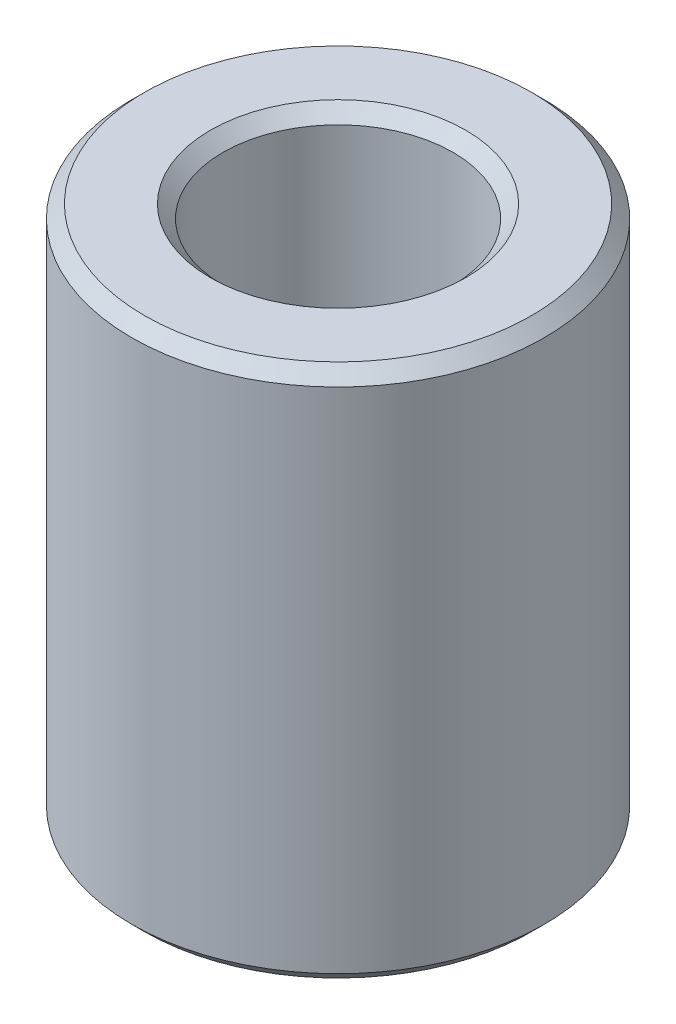
ISO-10303-21;
HEADER;
FILE_DESCRIPTION(('STEP AP214'),'2;1');
FILE_NAME('part.step','',(''),(''),'','','');
FILE_SCHEMA(('AUTOMOTIVE_DESIGN { 1 0 10303 214 1 1 1 1 }'));
ENDSEC;
DATA;
#1=APPLICATION_CONTEXT('core data for automotive mechanical design processes');
#2=APPLICATION_PROTOCOL_DEFINITION('international standard','automotive_design',2000,#1);
#3=PRODUCT_CONTEXT('',#1,'mechanical');
#4=PRODUCT('Part','Part','',(#3));
#5=PRODUCT_RELATED_PRODUCT_CATEGORY('part','',(#4));
#6=PRODUCT_DEFINITION_FORMATION('','',#4);
#7=PRODUCT_DEFINITION_CONTEXT('part definition',#1,'design');
#8=PRODUCT_DEFINITION('design','',#6,#7);
#9=PRODUCT_DEFINITION_SHAPE('','',#8);
#10=(LENGTH_UNIT() NAMED_UNIT(*) SI_UNIT(.MILLI.,.METRE.));
#11=(NAMED_UNIT(*) PLANE_ANGLE_UNIT() SI_UNIT($,.RADIAN.));
#12=(NAMED_UNIT(*) SI_UNIT($,.STERADIAN.) SOLID_ANGLE_UNIT());
#13=UNCERTAINTY_MEASURE_WITH_UNIT(LENGTH_MEASURE(1.E-05),#10,'distance_accuracy_value','');
#14=(GEOMETRIC_REPRESENTATION_CONTEXT(3) GLOBAL_UNCERTAINTY_ASSIGNED_CONTEXT((#13)) GLOBAL_UNIT_ASSIGNED_CONTEXT((#10,
#11,#12)) REPRESENTATION_CONTEXT('',''));
#15=CARTESIAN_POINT('',(0.,0.,0.));
#16=DIRECTION('',(0.,0.,1.));
#17=DIRECTION('',(1.,0.,0.));
#18=AXIS2_PLACEMENT_3D('',#15,#16,#17);
#19=CARTESIAN_POINT('',(0.,135.818795170149,0.));
#20=DIRECTION('',(0.,-1.,0.));
#21=DIRECTION('',(0.,0.,-1.));
#22=AXIS2_PLACEMENT_3D('',#19,#20,#21);
#23=CYLINDRICAL_SURFACE('',#22,52.5);
#24=CARTESIAN_POINT('',(0.,3.24465104762156,0.));
#25=DIRECTION('',(0.,1.,0.));
#26=DIRECTION('',(0.,0.,1.));
#27=AXIS2_PLACEMENT_3D('',#24,#25,#26);
#28=CIRCLE('',#27,52.5);
#29=CARTESIAN_POINT('',(0.,3.24465104762156,52.5));
#30=VERTEX_POINT('',#29);
#31=EDGE_CURVE('E10',#30,#30,#28,.T.);
#32=ORIENTED_EDGE('',*,*,#31,.T.);
#33=EDGE_LOOP('',(#32));
#34=FACE_BOUND('',#33,.T.);
#35=CARTESIAN_POINT('',(0.,132.574144122527,0.));
#36=DIRECTION('',(0.,1.,0.));
#37=DIRECTION('',(0.,0.,1.));
#38=AXIS2_PLACEMENT_3D('',#35,#36,#37);
#39=CIRCLE('',#38,52.5);
#40=CARTESIAN_POINT('',(0.,132.574144122527,52.5));
#41=VERTEX_POINT('',#40);
#42=EDGE_CURVE('E50',#41,#41,#39,.F.);
#43=ORIENTED_EDGE('',*,*,#42,.T.);
#44=EDGE_LOOP('',(#43));
#45=FACE_BOUND('',#44,.T.);
#46=ADVANCED_FACE('F39',(#34,#45),#23,.T.);
#47=CARTESIAN_POINT('',(0.,135.818795170149,0.));
#48=DIRECTION('',(0.,1.,0.));
#49=DIRECTION('',(0.,0.,1.));
#50=AXIS2_PLACEMENT_3D('',#47,#48,#49);
#51=PLANE('',#50);
#52=CARTESIAN_POINT('',(0.,135.818795170149,0.));
#53=DIRECTION('',(0.,1.,0.));
#54=DIRECTION('',(0.,0.,1.));
#55=AXIS2_PLACEMENT_3D('',#52,#53,#54);
#56=CIRCLE('',#55,32.514429171409);
#57=CARTESIAN_POINT('',(0.,135.818795170149,32.514429171409));
#58=VERTEX_POINT('',#57);
#59=EDGE_CURVE('E58',#58,#58,#56,.F.);
#60=ORIENTED_EDGE('',*,*,#59,.T.);
#61=EDGE_LOOP('',(#60));
#62=FACE_BOUND('',#61,.T.);
#63=CARTESIAN_POINT('',(0.,135.818795170149,0.));
#64=DIRECTION('',(0.,1.,0.));
#65=DIRECTION('',(0.,0.,1.));
#66=AXIS2_PLACEMENT_3D('',#63,#64,#65);
#67=CIRCLE('',#66,49.2553489523784);
#68=CARTESIAN_POINT('',(0.,135.818795170149,49.2553489523784));
#69=VERTEX_POINT('',#68);
#70=EDGE_CURVE('E61',#69,#69,#67,.T.);
#71=ORIENTED_EDGE('',*,*,#70,.T.);
#72=EDGE_LOOP('',(#71));
#73=FACE_BOUND('',#72,.T.);
#74=ADVANCED_FACE('F88',(#62,#73),#51,.T.);
#75=CARTESIAN_POINT('',(0.,0.,0.));
#76=DIRECTION('',(0.,1.,0.));
#77=DIRECTION('',(0.,0.,1.));
#78=AXIS2_PLACEMENT_3D('',#75,#76,#77);
#79=PLANE('',#78);
#80=CARTESIAN_POINT('',(0.,0.,0.));
#81=DIRECTION('',(0.,1.,0.));
#82=DIRECTION('',(0.,0.,1.));
#83=AXIS2_PLACEMENT_3D('',#80,#81,#82);
#84=CIRCLE('',#83,32.514429171409);
#85=CARTESIAN_POINT('',(0.,0.,32.514429171409));
#86=VERTEX_POINT('',#85);
#87=EDGE_CURVE('E51',#86,#86,#84,.T.);
#88=ORIENTED_EDGE('',*,*,#87,.T.);
#89=EDGE_LOOP('',(#88));
#90=FACE_BOUND('',#89,.T.);
#91=CARTESIAN_POINT('',(0.,0.,0.));
#92=DIRECTION('',(0.,1.,0.));
#93=DIRECTION('',(0.,0.,1.));
#94=AXIS2_PLACEMENT_3D('',#91,#92,#93);
#95=CIRCLE('',#94,49.2553489523784);
#96=CARTESIAN_POINT('',(0.,0.,49.2553489523784));
#97=VERTEX_POINT('',#96);
#98=EDGE_CURVE('E54',#97,#97,#95,.F.);
#99=ORIENTED_EDGE('',*,*,#98,.T.);
#100=EDGE_LOOP('',(#99));
#101=FACE_BOUND('',#100,.T.);
#102=ADVANCED_FACE('F83',(#90,#101),#79,.F.);
#103=CARTESIAN_POINT('',(0.,135.818795170149,0.));
#104=DIRECTION('',(0.,-1.,0.));
#105=DIRECTION('',(0.,0.,-1.));
#106=AXIS2_PLACEMENT_3D('',#103,#104,#105);
#107=CYLINDRICAL_SURFACE('',#106,29.2697781237874);
#108=CARTESIAN_POINT('',(0.,132.574144122528,0.));
#109=DIRECTION('',(0.,1.,0.));
#110=DIRECTION('',(0.,0.,1.));
#111=AXIS2_PLACEMENT_3D('',#108,#109,#110);
#112=CIRCLE('',#111,29.2697781237874);
#113=CARTESIAN_POINT('',(0.,132.574144122527,29.2697781237874));
#114=VERTEX_POINT('',#113);
#115=EDGE_CURVE('E67',#114,#114,#112,.T.);
#116=ORIENTED_EDGE('',*,*,#115,.T.);
#117=EDGE_LOOP('',(#116));
#118=FACE_BOUND('',#117,.T.);
#119=CARTESIAN_POINT('',(0.,3.24465104762159,0.));
#120=DIRECTION('',(0.,1.,0.));
#121=DIRECTION('',(0.,0.,1.));
#122=AXIS2_PLACEMENT_3D('',#119,#120,#121);
#123=CIRCLE('',#122,29.2697781237874);
#124=CARTESIAN_POINT('',(0.,3.24465104762159,29.2697781237874));
#125=VERTEX_POINT('',#124);
#126=EDGE_CURVE('E69',#125,#125,#123,.F.);
#127=ORIENTED_EDGE('',*,*,#126,.T.);
#128=EDGE_LOOP('',(#127));
#129=FACE_BOUND('',#128,.T.);
#130=ADVANCED_FACE('F71',(#118,#129),#107,.F.);
#131=CARTESIAN_POINT('',(0.,132.574144122528,0.));
#132=DIRECTION('',(0.,1.,0.));
#133=DIRECTION('',(0.,0.,1.));
#134=AXIS2_PLACEMENT_3D('',#131,#132,#133);
#135=CONICAL_SURFACE('',#134,29.2697781237874,0.785398163397447);
#136=CARTESIAN_POINT('',(0.,135.818795170149,32.514429171409));
#137=CARTESIAN_POINT('',(0.,135.784996721736,32.4806307229962));
#138=CARTESIAN_POINT('',(0.,135.751198273324,32.4468322745835));
#139=CARTESIAN_POINT('',(0.,135.683601376498,32.3792353777581));
#140=CARTESIAN_POINT('',(0.,135.649802928085,32.3454369293453));
#141=CARTESIAN_POINT('',(0.,135.58220603126,32.2778400325199));
#142=CARTESIAN_POINT('',(0.,135.548407582847,32.2440415841072));
#143=CARTESIAN_POINT('',(0.,135.480810686022,32.1764446872817));
#144=CARTESIAN_POINT('',(0.,135.447012237609,32.142646238869));
#145=CARTESIAN_POINT('',(0.,135.379415340784,32.0750493420435));
#146=CARTESIAN_POINT('',(0.,135.345616892371,32.0412508936308));
#147=CARTESIAN_POINT('',(0.,135.278019995545,31.9736539968054));
#148=CARTESIAN_POINT('',(0.,135.244221547133,31.9398555483927));
#149=CARTESIAN_POINT('',(0.,135.176624650307,31.8722586515672));
#150=CARTESIAN_POINT('',(0.,135.142826201895,31.8384602031545));
#151=CARTESIAN_POINT('',(0.,135.075229305069,31.770863306329));
#152=CARTESIAN_POINT('',(0.,135.041430856656,31.7370648579163));
#153=CARTESIAN_POINT('',(0.,134.973833959831,31.6694679610909));
#154=CARTESIAN_POINT('',(0.,134.940035511418,31.6356695126781));
#155=CARTESIAN_POINT('',(0.,134.872438614593,31.5680726158527));
#156=CARTESIAN_POINT('',(0.,134.83864016618,31.53427416744));
#157=CARTESIAN_POINT('',(0.,134.771043269355,31.4666772706145));
#158=CARTESIAN_POINT('',(0.,134.737244820942,31.4328788222018));
#159=CARTESIAN_POINT('',(0.,134.669647924116,31.3652819253763));
#160=CARTESIAN_POINT('',(0.,134.635849475704,31.3314834769636));
#161=CARTESIAN_POINT('',(0.,134.568252578878,31.2638865801382));
#162=CARTESIAN_POINT('',(0.,134.534454130466,31.2300881317254));
#163=CARTESIAN_POINT('',(0.,134.46685723364,31.1624912349));
#164=CARTESIAN_POINT('',(0.,134.433058785227,31.1286927864873));
#165=CARTESIAN_POINT('',(0.,134.365461888402,31.0610958896618));
#166=CARTESIAN_POINT('',(0.,134.331663439989,31.0272974412491));
#167=CARTESIAN_POINT('',(0.,134.264066543164,30.9597005444236));
#168=CARTESIAN_POINT('',(0.,134.230268094751,30.9259020960109));
#169=CARTESIAN_POINT('',(0.,134.162671197926,30.8583051991855));
#170=CARTESIAN_POINT('',(0.,134.128872749513,30.8245067507727));
#171=CARTESIAN_POINT('',(0.,134.061275852687,30.7569098539473));
#172=CARTESIAN_POINT('',(0.,134.027477404275,30.7231114055346));
#173=CARTESIAN_POINT('',(0.,133.959880507449,30.6555145087091));
#174=CARTESIAN_POINT('',(0.,133.926082059037,30.6217160602964));
#175=CARTESIAN_POINT('',(0.,133.858485162211,30.5541191634709));
#176=CARTESIAN_POINT('',(0.,133.824686713798,30.5203207150582));
#177=CARTESIAN_POINT('',(0.,133.757089816973,30.4527238182328));
#178=CARTESIAN_POINT('',(0.,133.72329136856,30.4189253698201));
#179=CARTESIAN_POINT('',(0.,133.655694471735,30.3513284729946));
#180=CARTESIAN_POINT('',(0.,133.621896023322,30.3175300245819));
#181=CARTESIAN_POINT('',(0.,133.554299126497,30.2499331277564));
#182=CARTESIAN_POINT('',(0.,133.520500678084,30.2161346793437));
#183=CARTESIAN_POINT('',(0.,133.452903781258,30.1485377825183));
#184=CARTESIAN_POINT('',(0.,133.419105332846,30.1147393341055));
#185=CARTESIAN_POINT('',(0.,133.35150843602,30.0471424372801));
#186=CARTESIAN_POINT('',(0.,133.317709987607,30.0133439888674));
#187=CARTESIAN_POINT('',(0.,133.250113090782,29.9457470920419));
#188=CARTESIAN_POINT('',(0.,133.216314642369,29.9119486436292));
#189=CARTESIAN_POINT('',(0.,133.148717745544,29.8443517468037));
#190=CARTESIAN_POINT('',(0.,133.114919297131,29.810553298391));
#191=CARTESIAN_POINT('',(0.,133.047322400306,29.7429564015656));
#192=CARTESIAN_POINT('',(0.,133.013523951893,29.7091579531528));
#193=CARTESIAN_POINT('',(0.,132.945927055067,29.6415610563274));
#194=CARTESIAN_POINT('',(0.,132.912128606655,29.6077626079147));
#195=CARTESIAN_POINT('',(0.,132.844531709829,29.5401657110892));
#196=CARTESIAN_POINT('',(0.,132.810733261417,29.5063672626765));
#197=CARTESIAN_POINT('',(0.,132.743136364591,29.438770365851));
#198=CARTESIAN_POINT('',(0.,132.709337916178,29.4049719174383));
#199=CARTESIAN_POINT('',(0.,132.641741019353,29.3373750206129));
#200=CARTESIAN_POINT('',(0.,132.60794257094,29.3035765722001));
#201=CARTESIAN_POINT('',(0.,132.574144122528,29.2697781237874));
#202=B_SPLINE_CURVE_WITH_KNOTS('',3,(#136,#137,#138,#139,#140,#141,#142,#143,#144,#145,#146,
#147,#148,#149,#150,#151,#152,#153,#154,#155,#156,#157,#158,#159,#160,#161,#162,#163,#164,#165,
#166,#167,#168,#169,#170,#171,#172,#173,#174,#175,#176,#177,#178,#179,#180,#181,#182,#183,#184,
#185,#186,#187,#188,#189,#190,#191,#192,#193,#194,#195,#196,#197,#198,#199,#200,#201),
.UNSPECIFIED.,.F.,.F.,(4,2,2,2,2,2,2,2,2,2,2,2,2,2,2,2,2,2,2,2,2,2,2,2,2,2,2,2,2,2,2,2,4),(0.,
0.14339467239733,0.286789344794655,0.430184017191985,0.573578689589315,0.71697336198664,
0.86036803438397,1.0037627067813,1.14715737917863,1.29055205157596,1.43394672397329,
1.57734139637062,1.72073606876794,1.86413074116527,2.0075254135626,2.15092008595993,
2.29431475835724,2.43770943075457,2.58110410315189,2.72449877554922,2.86789344794655,
3.01128812034388,3.15468279274121,3.29807746513854,3.44147213753587,3.58486680993319,
3.72826148233052,3.87165615472785,4.01505082712518,4.15844549952251,4.30184017191984,
4.44523484431717,4.58862951671448),.UNSPECIFIED.);
#203=EDGE_CURVE('BSEAM77',#58,#114,#202,.T.);
#204=ORIENTED_EDGE('',*,*,#59,.F.);
#205=ORIENTED_EDGE('',*,*,#115,.F.);
#206=ORIENTED_EDGE('',*,*,#203,.T.);
#207=ORIENTED_EDGE('',*,*,#203,.F.);
#208=EDGE_LOOP('',(#204,#206,#205,#207));
#209=FACE_BOUND('',#208,.T.);
#210=ADVANCED_FACE('F77',(#209),#135,.F.);
#211=CARTESIAN_POINT('',(0.,0.,0.));
#212=DIRECTION('',(0.,-1.,0.));
#213=DIRECTION('',(0.,0.,-1.));
#214=AXIS2_PLACEMENT_3D('',#211,#212,#213);
#215=CONICAL_SURFACE('',#214,32.514429171409,0.785398163397447);
#216=ORIENTED_EDGE('',*,*,#126,.F.);
#217=EDGE_LOOP('',(#216));
#218=FACE_BOUND('',#217,.T.);
#219=ORIENTED_EDGE('',*,*,#87,.F.);
#220=EDGE_LOOP('',(#219));
#221=FACE_BOUND('',#220,.T.);
#222=ADVANCED_FACE('F73',(#218,#221),#215,.F.);
#223=CARTESIAN_POINT('',(0.,3.24465104762156,0.));
#224=DIRECTION('',(0.,1.,0.));
#225=DIRECTION('',(0.,0.,1.));
#226=AXIS2_PLACEMENT_3D('',#223,#224,#225);
#227=CONICAL_SURFACE('',#226,52.5,0.785398163397451);
#228=CARTESIAN_POINT('',(0.,0.,49.2553489523784));
#229=CARTESIAN_POINT('',(0.,0.033798448412725,49.2891474007911));
#230=CARTESIAN_POINT('',(0.,0.0675968968254491,49.3229458492039));
#231=CARTESIAN_POINT('',(0.,0.135193793650898,49.3905427460293));
#232=CARTESIAN_POINT('',(0.,0.168992242063622,49.424341194442));
#233=CARTESIAN_POINT('',(0.,0.236589138889071,49.4919380912675));
#234=CARTESIAN_POINT('',(0.,0.270387587301797,49.5257365396802));
#235=CARTESIAN_POINT('',(0.,0.337984484127246,49.5933334365057));
#236=CARTESIAN_POINT('',(0.,0.37178293253997,49.6271318849184));
#237=CARTESIAN_POINT('',(0.,0.439379829365419,49.6947287817438));
#238=CARTESIAN_POINT('',(0.,0.473178277778144,49.7285272301566));
#239=CARTESIAN_POINT('',(0.,0.540775174603593,49.796124126982));
#240=CARTESIAN_POINT('',(0.,0.574573623016318,49.8299225753947));
#241=CARTESIAN_POINT('',(0.,0.642170519841767,49.8975194722202));
#242=CARTESIAN_POINT('',(0.,0.675968968254492,49.9313179206329));
#243=CARTESIAN_POINT('',(0.,0.74356586507994,49.9989148174584));
#244=CARTESIAN_POINT('',(0.,0.777364313492664,50.0327132658711));
#245=CARTESIAN_POINT('',(0.,0.844961210318114,50.1003101626965));
#246=CARTESIAN_POINT('',(0.,0.878759658730839,50.1341086111093));
#247=CARTESIAN_POINT('',(0.,0.946356555556289,50.2017055079347));
#248=CARTESIAN_POINT('',(0.,0.980155003969013,50.2355039563474));
#249=CARTESIAN_POINT('',(0.,1.04775190079446,50.3031008531729));
#250=CARTESIAN_POINT('',(0.,1.08155034920719,50.3368993015856));
#251=CARTESIAN_POINT('',(0.,1.14914724603264,50.4044961984111));
#252=CARTESIAN_POINT('',(0.,1.18294569444536,50.4382946468238));
#253=CARTESIAN_POINT('',(0.,1.25054259127081,50.5058915436492));
#254=CARTESIAN_POINT('',(0.,1.28434103968353,50.539689992062));
#255=CARTESIAN_POINT('',(0.,1.35193793650898,50.6072868888874));
#256=CARTESIAN_POINT('',(0.,1.38573638492171,50.6410853373001));
#257=CARTESIAN_POINT('',(0.,1.45333328174716,50.7086822341256));
#258=CARTESIAN_POINT('',(0.,1.48713173015988,50.7424806825383));
#259=CARTESIAN_POINT('',(0.,1.55472862698533,50.8100775793638));
#260=CARTESIAN_POINT('',(0.,1.58852707539806,50.8438760277765));
#261=CARTESIAN_POINT('',(0.,1.65612397222351,50.9114729246019));
#262=CARTESIAN_POINT('',(0.,1.68992242063623,50.9452713730147));
#263=CARTESIAN_POINT('',(0.,1.75751931746168,51.0128682698401));
#264=CARTESIAN_POINT('',(0.,1.7913177658744,51.0466667182528));
#265=CARTESIAN_POINT('',(0.,1.85891466269985,51.1142636150783));
#266=CARTESIAN_POINT('',(0.,1.89271311111258,51.148062063491));
#267=CARTESIAN_POINT('',(0.,1.96031000793803,51.2156589603165));
#268=CARTESIAN_POINT('',(0.,1.99410845635075,51.2494574087292));
#269=CARTESIAN_POINT('',(0.,2.0617053531762,51.3170543055546));
#270=CARTESIAN_POINT('',(0.,2.09550380158892,51.3508527539674));
#271=CARTESIAN_POINT('',(0.,2.16310069841437,51.4184496507928));
#272=CARTESIAN_POINT('',(0.,2.1968991468271,51.4522480992055));
#273=CARTESIAN_POINT('',(0.,2.26449604365255,51.519844996031));
#274=CARTESIAN_POINT('',(0.,2.29829449206527,51.5536434444437));
#275=CARTESIAN_POINT('',(0.,2.36589138889072,51.6212403412692));
#276=CARTESIAN_POINT('',(0.,2.39968983730345,51.6550387896819));
#277=CARTESIAN_POINT('',(0.,2.46728673412889,51.7226356865073));
#278=CARTESIAN_POINT('',(0.,2.50108518254162,51.75643413492));
#279=CARTESIAN_POINT('',(0.,2.56868207936707,51.8240310317455));
#280=CARTESIAN_POINT('',(0.,2.60248052777979,51.8578294801582));
#281=CARTESIAN_POINT('',(0.,2.67007742460524,51.9254263769837));
#282=CARTESIAN_POINT('',(0.,2.70387587301797,51.9592248253964));
#283=CARTESIAN_POINT('',(0.,2.77147276984342,52.0268217222219));
#284=CARTESIAN_POINT('',(0.,2.80527121825614,52.0606201706346));
#285=CARTESIAN_POINT('',(0.,2.87286811508159,52.12821706746));
#286=CARTESIAN_POINT('',(0.,2.90666656349431,52.1620155158727));
#287=CARTESIAN_POINT('',(0.,2.97426346031976,52.2296124126982));
#288=CARTESIAN_POINT('',(0.,3.00806190873249,52.2634108611109));
#289=CARTESIAN_POINT('',(0.,3.07565880555794,52.3310077579364));
#290=CARTESIAN_POINT('',(0.,3.10945725397066,52.3648062063491));
#291=CARTESIAN_POINT('',(0.,3.17705415079611,52.4324031031746));
#292=CARTESIAN_POINT('',(0.,3.21085259920884,52.4662015515873));
#293=CARTESIAN_POINT('',(0.,3.24465104762156,52.5));
#294=B_SPLINE_CURVE_WITH_KNOTS('',3,(#228,#229,#230,#231,#232,#233,#234,#235,#236,#237,#238,
#239,#240,#241,#242,#243,#244,#245,#246,#247,#248,#249,#250,#251,#252,#253,#254,#255,#256,#257,
#258,#259,#260,#261,#262,#263,#264,#265,#266,#267,#268,#269,#270,#271,#272,#273,#274,#275,#276,
#277,#278,#279,#280,#281,#282,#283,#284,#285,#286,#287,#288,#289,#290,#291,#292,#293),
.UNSPECIFIED.,.F.,.F.,(4,2,2,2,2,2,2,2,2,2,2,2,2,2,2,2,2,2,2,2,2,2,2,2,2,2,2,2,2,2,2,2,4),(0.,
0.143394672397329,0.286789344794658,0.430184017191981,0.57357868958931,0.716973361986639,
0.860368034383968,1.0037627067813,1.14715737917863,1.29055205157595,1.43394672397328,
1.57734139637061,1.72073606876794,1.86413074116526,2.00752541356259,2.15092008595992,
2.29431475835725,2.43770943075457,2.5811041031519,2.72449877554923,2.86789344794656,
3.01128812034389,3.15468279274121,3.29807746513854,3.44147213753587,3.5848668099332,
3.72826148233053,3.87165615472786,4.01505082712518,4.15844549952251,4.30184017191984,
4.44523484431717,4.5886295167145),.UNSPECIFIED.);
#295=EDGE_CURVE('BSEAM76',#97,#30,#294,.T.);
#296=ORIENTED_EDGE('',*,*,#98,.F.);
#297=ORIENTED_EDGE('',*,*,#31,.F.);
#298=ORIENTED_EDGE('',*,*,#295,.T.);
#299=ORIENTED_EDGE('',*,*,#295,.F.);
#300=EDGE_LOOP('',(#296,#298,#297,#299));
#301=FACE_BOUND('',#300,.T.);
#302=ADVANCED_FACE('F76',(#301),#227,.T.);
#303=CARTESIAN_POINT('',(0.,135.818795170149,0.));
#304=DIRECTION('',(0.,-1.,0.));
#305=DIRECTION('',(0.,0.,-1.));
#306=AXIS2_PLACEMENT_3D('',#303,#304,#305);
#307=CONICAL_SURFACE('',#306,49.2553489523784,0.785398163397445);
#308=ORIENTED_EDGE('',*,*,#42,.F.);
#309=EDGE_LOOP('',(#308));
#310=FACE_BOUND('',#309,.T.);
#311=ORIENTED_EDGE('',*,*,#70,.F.);
#312=EDGE_LOOP('',(#311));
#313=FACE_BOUND('',#312,.T.);
#314=ADVANCED_FACE('F45',(#310,#313),#307,.T.);
#315=CLOSED_SHELL('',(#46,#74,#102,#130,#210,#222,#302,#314));
#316=MANIFOLD_SOLID_BREP('B2',#315);
#317=ADVANCED_BREP_SHAPE_REPRESENTATION('',(#18,#316),#14);
#318=SHAPE_DEFINITION_REPRESENTATION(#9,#317);
ENDSEC;
END-ISO-10303-21;
